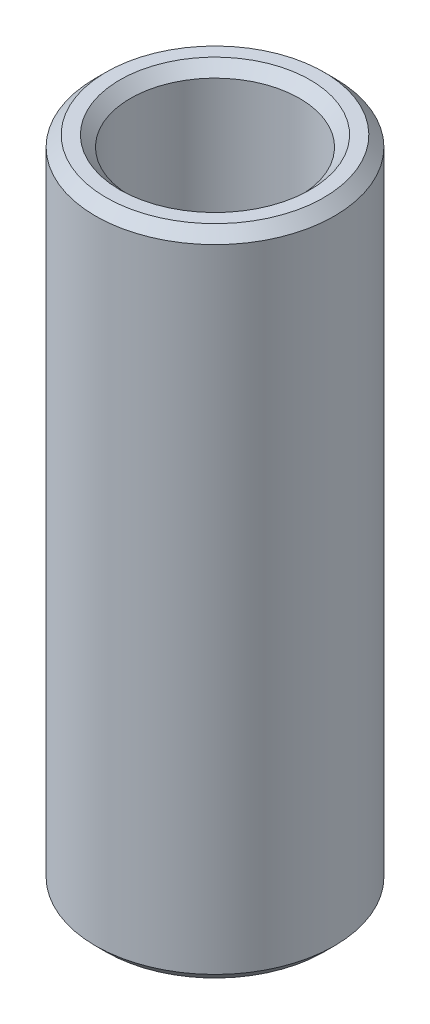
ISO-10303-21;
HEADER;
FILE_DESCRIPTION(('STEP AP214'),'2;1');
FILE_NAME('part.step','',(''),(''),'','','');
FILE_SCHEMA(('AUTOMOTIVE_DESIGN { 1 0 10303 214 1 1 1 1 }'));
ENDSEC;
DATA;
#1=APPLICATION_CONTEXT('core data for automotive mechanical design processes');
#2=APPLICATION_PROTOCOL_DEFINITION('international standard','automotive_design',2000,#1);
#3=PRODUCT_CONTEXT('',#1,'mechanical');
#4=PRODUCT('Part','Part','',(#3));
#5=PRODUCT_RELATED_PRODUCT_CATEGORY('part','',(#4));
#6=PRODUCT_DEFINITION_FORMATION('','',#4);
#7=PRODUCT_DEFINITION_CONTEXT('part definition',#1,'design');
#8=PRODUCT_DEFINITION('design','',#6,#7);
#9=PRODUCT_DEFINITION_SHAPE('','',#8);
#10=(LENGTH_UNIT() NAMED_UNIT(*) SI_UNIT(.MILLI.,.METRE.));
#11=(NAMED_UNIT(*) PLANE_ANGLE_UNIT() SI_UNIT($,.RADIAN.));
#12=(NAMED_UNIT(*) SI_UNIT($,.STERADIAN.) SOLID_ANGLE_UNIT());
#13=UNCERTAINTY_MEASURE_WITH_UNIT(LENGTH_MEASURE(1.E-05),#10,'distance_accuracy_value','');
#14=(GEOMETRIC_REPRESENTATION_CONTEXT(3) GLOBAL_UNCERTAINTY_ASSIGNED_CONTEXT((#13)) GLOBAL_UNIT_ASSIGNED_CONTEXT((#10,
#11,#12)) REPRESENTATION_CONTEXT('',''));
#15=CARTESIAN_POINT('',(0.,0.,0.));
#16=DIRECTION('',(0.,0.,1.));
#17=DIRECTION('',(1.,0.,0.));
#18=AXIS2_PLACEMENT_3D('',#15,#16,#17);
#19=CARTESIAN_POINT('',(0.,82.0456073704507,0.));
#20=DIRECTION('',(0.,-1.,0.));
#21=DIRECTION('',(0.,0.,-1.));
#22=AXIS2_PLACEMENT_3D('',#19,#20,#21);
#23=CYLINDRICAL_SURFACE('',#22,15.);
#24=CARTESIAN_POINT('',(0.,1.33709407482219,0.));
#25=DIRECTION('',(0.,1.,0.));
#26=DIRECTION('',(0.,0.,1.));
#27=AXIS2_PLACEMENT_3D('',#24,#25,#26);
#28=CIRCLE('',#27,15.);
#29=CARTESIAN_POINT('',(0.,1.33709407482219,15.));
#30=VERTEX_POINT('',#29);
#31=EDGE_CURVE('E10',#30,#30,#28,.T.);
#32=ORIENTED_EDGE('',*,*,#31,.T.);
#33=EDGE_LOOP('',(#32));
#34=FACE_BOUND('',#33,.T.);
#35=CARTESIAN_POINT('',(0.,80.7085132956285,0.));
#36=DIRECTION('',(0.,1.,0.));
#37=DIRECTION('',(0.,0.,1.));
#38=AXIS2_PLACEMENT_3D('',#35,#36,#37);
#39=CIRCLE('',#38,15.);
#40=CARTESIAN_POINT('',(0.,80.7085132956285,15.));
#41=VERTEX_POINT('',#40);
#42=EDGE_CURVE('E50',#41,#41,#39,.F.);
#43=ORIENTED_EDGE('',*,*,#42,.T.);
#44=EDGE_LOOP('',(#43));
#45=FACE_BOUND('',#44,.T.);
#46=ADVANCED_FACE('F39',(#34,#45),#23,.T.);
#47=CARTESIAN_POINT('',(0.,82.0456073704507,0.));
#48=DIRECTION('',(0.,1.,0.));
#49=DIRECTION('',(0.,0.,1.));
#50=AXIS2_PLACEMENT_3D('',#47,#48,#49);
#51=PLANE('',#50);
#52=CARTESIAN_POINT('',(0.,82.0456073704507,0.));
#53=DIRECTION('',(0.,1.,0.));
#54=DIRECTION('',(0.,0.,1.));
#55=AXIS2_PLACEMENT_3D('',#52,#53,#54);
#56=CIRCLE('',#55,11.9551455088655);
#57=CARTESIAN_POINT('',(0.,82.0456073704507,11.9551455088655));
#58=VERTEX_POINT('',#57);
#59=EDGE_CURVE('E58',#58,#58,#56,.F.);
#60=ORIENTED_EDGE('',*,*,#59,.T.);
#61=EDGE_LOOP('',(#60));
#62=FACE_BOUND('',#61,.T.);
#63=CARTESIAN_POINT('',(0.,82.0456073704507,0.));
#64=DIRECTION('',(0.,1.,0.));
#65=DIRECTION('',(0.,0.,1.));
#66=AXIS2_PLACEMENT_3D('',#63,#64,#65);
#67=CIRCLE('',#66,13.6629059251778);
#68=CARTESIAN_POINT('',(0.,82.0456073704507,13.6629059251778));
#69=VERTEX_POINT('',#68);
#70=EDGE_CURVE('E61',#69,#69,#67,.T.);
#71=ORIENTED_EDGE('',*,*,#70,.T.);
#72=EDGE_LOOP('',(#71));
#73=FACE_BOUND('',#72,.T.);
#74=ADVANCED_FACE('F88',(#62,#73),#51,.T.);
#75=CARTESIAN_POINT('',(0.,0.,0.));
#76=DIRECTION('',(0.,1.,0.));
#77=DIRECTION('',(0.,0.,1.));
#78=AXIS2_PLACEMENT_3D('',#75,#76,#77);
#79=PLANE('',#78);
#80=CARTESIAN_POINT('',(0.,0.,0.));
#81=DIRECTION('',(0.,1.,0.));
#82=DIRECTION('',(0.,0.,1.));
#83=AXIS2_PLACEMENT_3D('',#80,#81,#82);
#84=CIRCLE('',#83,11.9551455088655);
#85=CARTESIAN_POINT('',(0.,0.,11.9551455088655));
#86=VERTEX_POINT('',#85);
#87=EDGE_CURVE('E51',#86,#86,#84,.T.);
#88=ORIENTED_EDGE('',*,*,#87,.T.);
#89=EDGE_LOOP('',(#88));
#90=FACE_BOUND('',#89,.T.);
#91=CARTESIAN_POINT('',(0.,0.,0.));
#92=DIRECTION('',(0.,1.,0.));
#93=DIRECTION('',(0.,0.,1.));
#94=AXIS2_PLACEMENT_3D('',#91,#92,#93);
#95=CIRCLE('',#94,13.6629059251778);
#96=CARTESIAN_POINT('',(0.,0.,13.6629059251778));
#97=VERTEX_POINT('',#96);
#98=EDGE_CURVE('E54',#97,#97,#95,.F.);
#99=ORIENTED_EDGE('',*,*,#98,.T.);
#100=EDGE_LOOP('',(#99));
#101=FACE_BOUND('',#100,.T.);
#102=ADVANCED_FACE('F83',(#90,#101),#79,.F.);
#103=CARTESIAN_POINT('',(0.,82.0456073704507,0.));
#104=DIRECTION('',(0.,-1.,0.));
#105=DIRECTION('',(0.,0.,-1.));
#106=AXIS2_PLACEMENT_3D('',#103,#104,#105);
#107=CYLINDRICAL_SURFACE('',#106,10.6180514340433);
#108=CARTESIAN_POINT('',(0.,80.7085132956285,0.));
#109=DIRECTION('',(0.,1.,0.));
#110=DIRECTION('',(0.,0.,1.));
#111=AXIS2_PLACEMENT_3D('',#108,#109,#110);
#112=CIRCLE('',#111,10.6180514340433);
#113=CARTESIAN_POINT('',(0.,80.7085132956285,10.6180514340433));
#114=VERTEX_POINT('',#113);
#115=EDGE_CURVE('E67',#114,#114,#112,.T.);
#116=ORIENTED_EDGE('',*,*,#115,.T.);
#117=EDGE_LOOP('',(#116));
#118=FACE_BOUND('',#117,.T.);
#119=CARTESIAN_POINT('',(0.,1.33709407482221,0.));
#120=DIRECTION('',(0.,1.,0.));
#121=DIRECTION('',(0.,0.,1.));
#122=AXIS2_PLACEMENT_3D('',#119,#120,#121);
#123=CIRCLE('',#122,10.6180514340433);
#124=CARTESIAN_POINT('',(0.,1.33709407482221,10.6180514340433));
#125=VERTEX_POINT('',#124);
#126=EDGE_CURVE('E69',#125,#125,#123,.F.);
#127=ORIENTED_EDGE('',*,*,#126,.T.);
#128=EDGE_LOOP('',(#127));
#129=FACE_BOUND('',#128,.T.);
#130=ADVANCED_FACE('F71',(#118,#129),#107,.F.);
#131=CARTESIAN_POINT('',(0.,80.7085132956285,0.));
#132=DIRECTION('',(0.,1.,0.));
#133=DIRECTION('',(0.,0.,1.));
#134=AXIS2_PLACEMENT_3D('',#131,#132,#133);
#135=CONICAL_SURFACE('',#134,10.6180514340433,0.78539816339745);
#136=ORIENTED_EDGE('',*,*,#59,.F.);
#137=EDGE_LOOP('',(#136));
#138=FACE_BOUND('',#137,.T.);
#139=ORIENTED_EDGE('',*,*,#115,.F.);
#140=EDGE_LOOP('',(#139));
#141=FACE_BOUND('',#140,.T.);
#142=ADVANCED_FACE('F77',(#138,#141),#135,.F.);
#143=CARTESIAN_POINT('',(0.,0.,0.));
#144=DIRECTION('',(0.,-1.,0.));
#145=DIRECTION('',(0.,0.,-1.));
#146=AXIS2_PLACEMENT_3D('',#143,#144,#145);
#147=CONICAL_SURFACE('',#146,11.9551455088655,0.785398163397445);
#148=ORIENTED_EDGE('',*,*,#126,.F.);
#149=EDGE_LOOP('',(#148));
#150=FACE_BOUND('',#149,.T.);
#151=ORIENTED_EDGE('',*,*,#87,.F.);
#152=EDGE_LOOP('',(#151));
#153=FACE_BOUND('',#152,.T.);
#154=ADVANCED_FACE('F73',(#150,#153),#147,.F.);
#155=CARTESIAN_POINT('',(0.,1.33709407482219,0.));
#156=DIRECTION('',(0.,1.,0.));
#157=DIRECTION('',(0.,0.,1.));
#158=AXIS2_PLACEMENT_3D('',#155,#156,#157);
#159=CONICAL_SURFACE('',#158,15.,0.785398163397456);
#160=ORIENTED_EDGE('',*,*,#98,.F.);
#161=EDGE_LOOP('',(#160));
#162=FACE_BOUND('',#161,.T.);
#163=ORIENTED_EDGE('',*,*,#31,.F.);
#164=EDGE_LOOP('',(#163));
#165=FACE_BOUND('',#164,.T.);
#166=ADVANCED_FACE('F76',(#162,#165),#159,.T.);
#167=CARTESIAN_POINT('',(0.,82.0456073704507,0.));
#168=DIRECTION('',(0.,-1.,0.));
#169=DIRECTION('',(0.,0.,-1.));
#170=AXIS2_PLACEMENT_3D('',#167,#168,#169);
#171=CONICAL_SURFACE('',#170,13.6629059251778,0.785398163397448);
#172=ORIENTED_EDGE('',*,*,#42,.F.);
#173=EDGE_LOOP('',(#172));
#174=FACE_BOUND('',#173,.T.);
#175=ORIENTED_EDGE('',*,*,#70,.F.);
#176=EDGE_LOOP('',(#175));
#177=FACE_BOUND('',#176,.T.);
#178=ADVANCED_FACE('F45',(#174,#177),#171,.T.);
#179=CLOSED_SHELL('',(#46,#74,#102,#130,#142,#154,#166,#178));
#180=MANIFOLD_SOLID_BREP('B2',#179);
#181=ADVANCED_BREP_SHAPE_REPRESENTATION('',(#18,#180),#14);
#182=SHAPE_DEFINITION_REPRESENTATION(#9,#181);
ENDSEC;
END-ISO-10303-21;
